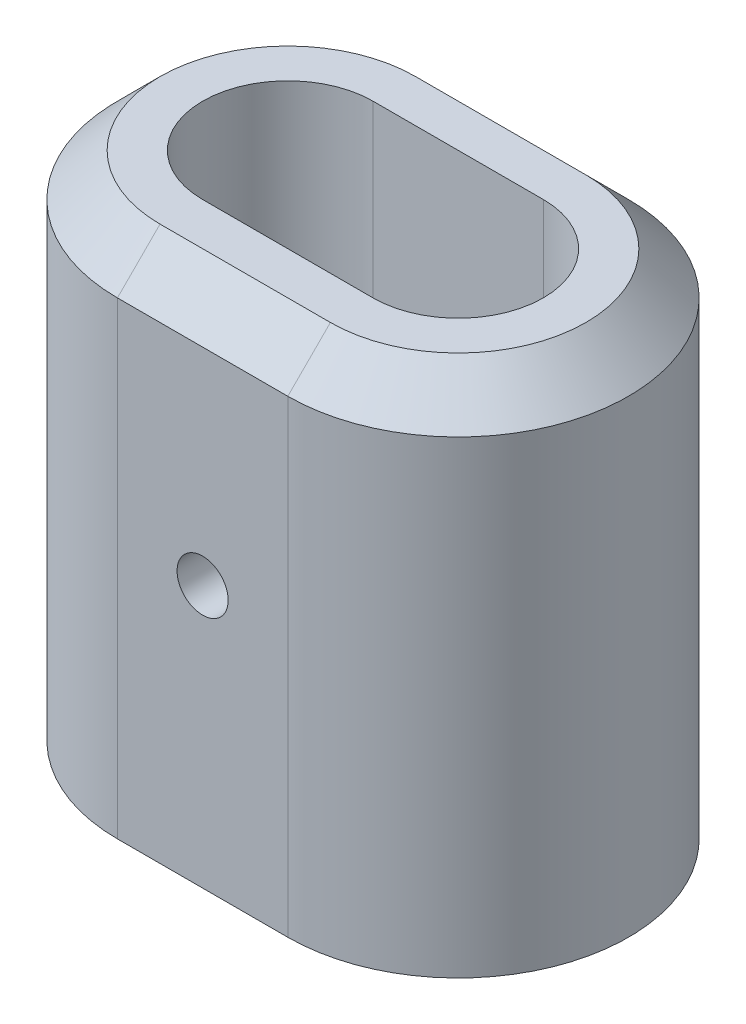
ISO-10303-21;
HEADER;
FILE_DESCRIPTION(('STEP AP214'),'2;1');
FILE_NAME('part.step','',(''),(''),'','','');
FILE_SCHEMA(('AUTOMOTIVE_DESIGN { 1 0 10303 214 1 1 1 1 }'));
ENDSEC;
DATA;
#1=APPLICATION_CONTEXT('core data for automotive mechanical design processes');
#2=APPLICATION_PROTOCOL_DEFINITION('international standard','automotive_design',2000,#1);
#3=PRODUCT_CONTEXT('',#1,'mechanical');
#4=PRODUCT('Part','Part','',(#3));
#5=PRODUCT_RELATED_PRODUCT_CATEGORY('part','',(#4));
#6=PRODUCT_DEFINITION_FORMATION('','',#4);
#7=PRODUCT_DEFINITION_CONTEXT('part definition',#1,'design');
#8=PRODUCT_DEFINITION('design','',#6,#7);
#9=PRODUCT_DEFINITION_SHAPE('','',#8);
#10=(LENGTH_UNIT() NAMED_UNIT(*) SI_UNIT(.MILLI.,.METRE.));
#11=(NAMED_UNIT(*) PLANE_ANGLE_UNIT() SI_UNIT($,.RADIAN.));
#12=(NAMED_UNIT(*) SI_UNIT($,.STERADIAN.) SOLID_ANGLE_UNIT());
#13=UNCERTAINTY_MEASURE_WITH_UNIT(LENGTH_MEASURE(1.E-05),#10,'distance_accuracy_value','');
#14=(GEOMETRIC_REPRESENTATION_CONTEXT(3) GLOBAL_UNCERTAINTY_ASSIGNED_CONTEXT((#13)) GLOBAL_UNIT_ASSIGNED_CONTEXT((#10,
#11,#12)) REPRESENTATION_CONTEXT('',''));
#15=CARTESIAN_POINT('',(0.,0.,0.));
#16=DIRECTION('',(0.,0.,1.));
#17=DIRECTION('',(1.,0.,0.));
#18=AXIS2_PLACEMENT_3D('',#15,#16,#17);
#19=CARTESIAN_POINT('',(-60.,30.,0.));
#20=DIRECTION('',(0.,1.,0.));
#21=DIRECTION('',(0.,0.,1.));
#22=AXIS2_PLACEMENT_3D('',#19,#20,#21);
#23=PLANE('',#22);
#24=DIRECTION('',(-1.,0.,0.));
#25=VECTOR('',#24,1.);
#26=CARTESIAN_POINT('',(-60.,30.,-15.));
#27=LINE('',#26,#25);
#28=CARTESIAN_POINT('',(-40.,30.,-15.));
#29=VERTEX_POINT('',#28);
#30=CARTESIAN_POINT('',(-60.,30.,-15.));
#31=VERTEX_POINT('',#30);
#32=EDGE_CURVE('E180',#29,#31,#27,.T.);
#33=ORIENTED_EDGE('',*,*,#32,.T.);
#34=CARTESIAN_POINT('',(-60.,30.,0.));
#35=DIRECTION('',(0.,1.,0.));
#36=DIRECTION('',(0.,0.,1.));
#37=AXIS2_PLACEMENT_3D('',#34,#35,#36);
#38=CIRCLE('',#37,15.);
#39=CARTESIAN_POINT('',(-60.,30.,15.));
#40=VERTEX_POINT('',#39);
#41=EDGE_CURVE('E182',#31,#40,#38,.T.);
#42=ORIENTED_EDGE('',*,*,#41,.T.);
#43=DIRECTION('',(1.,0.,0.));
#44=VECTOR('',#43,1.);
#45=CARTESIAN_POINT('',(-40.,30.,15.));
#46=LINE('',#45,#44);
#47=CARTESIAN_POINT('',(-40.,30.,15.));
#48=VERTEX_POINT('',#47);
#49=EDGE_CURVE('E178',#40,#48,#46,.T.);
#50=ORIENTED_EDGE('',*,*,#49,.T.);
#51=CARTESIAN_POINT('',(-40.,30.,0.));
#52=DIRECTION('',(0.,1.,0.));
#53=DIRECTION('',(0.,0.,1.));
#54=AXIS2_PLACEMENT_3D('',#51,#52,#53);
#55=CIRCLE('',#54,15.);
#56=EDGE_CURVE('E176',#48,#29,#55,.T.);
#57=ORIENTED_EDGE('',*,*,#56,.T.);
#58=EDGE_LOOP('',(#33,#42,#50,#57));
#59=FACE_BOUND('',#58,.T.);
#60=DIRECTION('',(1.,0.,0.));
#61=VECTOR('',#60,1.);
#62=CARTESIAN_POINT('',(-60.,30.,10.));
#63=LINE('',#62,#61);
#64=CARTESIAN_POINT('',(-60.,30.,10.));
#65=VERTEX_POINT('',#64);
#66=CARTESIAN_POINT('',(-40.,30.,10.));
#67=VERTEX_POINT('',#66);
#68=EDGE_CURVE('E124',#65,#67,#63,.T.);
#69=ORIENTED_EDGE('',*,*,#68,.F.);
#70=CARTESIAN_POINT('',(-60.,30.,0.));
#71=DIRECTION('',(0.,1.,0.));
#72=DIRECTION('',(0.,0.,1.));
#73=AXIS2_PLACEMENT_3D('',#70,#71,#72);
#74=CIRCLE('',#73,10.);
#75=CARTESIAN_POINT('',(-60.,30.,-10.));
#76=VERTEX_POINT('',#75);
#77=EDGE_CURVE('E114',#76,#65,#74,.T.);
#78=ORIENTED_EDGE('',*,*,#77,.F.);
#79=DIRECTION('',(-1.,0.,0.));
#80=VECTOR('',#79,1.);
#81=CARTESIAN_POINT('',(-60.,30.,-10.));
#82=LINE('',#81,#80);
#83=CARTESIAN_POINT('',(-40.,30.,-10.));
#84=VERTEX_POINT('',#83);
#85=EDGE_CURVE('E139',#84,#76,#82,.T.);
#86=ORIENTED_EDGE('',*,*,#85,.F.);
#87=CARTESIAN_POINT('',(-40.,30.,0.));
#88=DIRECTION('',(0.,1.,0.));
#89=DIRECTION('',(0.,0.,1.));
#90=AXIS2_PLACEMENT_3D('',#87,#88,#89);
#91=CIRCLE('',#90,10.);
#92=EDGE_CURVE('E137',#67,#84,#91,.T.);
#93=ORIENTED_EDGE('',*,*,#92,.F.);
#94=EDGE_LOOP('',(#69,#78,#86,#93));
#95=FACE_BOUND('',#94,.T.);
#96=ADVANCED_FACE('F35',(#59,#95),#23,.T.);
#97=CARTESIAN_POINT('',(-60.,-30.,0.));
#98=DIRECTION('',(0.,1.,0.));
#99=DIRECTION('',(0.,0.,1.));
#100=AXIS2_PLACEMENT_3D('',#97,#98,#99);
#101=PLANE('',#100);
#102=CARTESIAN_POINT('',(-60.,-30.,0.));
#103=DIRECTION('',(0.,1.,0.));
#104=DIRECTION('',(0.,0.,1.));
#105=AXIS2_PLACEMENT_3D('',#102,#103,#104);
#106=CIRCLE('',#105,20.);
#107=CARTESIAN_POINT('',(-60.,-30.,-20.));
#108=VERTEX_POINT('',#107);
#109=CARTESIAN_POINT('',(-60.,-30.,20.));
#110=VERTEX_POINT('',#109);
#111=EDGE_CURVE('E132',#108,#110,#106,.T.);
#112=ORIENTED_EDGE('',*,*,#111,.F.);
#113=DIRECTION('',(-1.,0.,0.));
#114=VECTOR('',#113,1.);
#115=CARTESIAN_POINT('',(-60.,-30.,-20.));
#116=LINE('',#115,#114);
#117=CARTESIAN_POINT('',(-40.,-30.,-20.));
#118=VERTEX_POINT('',#117);
#119=EDGE_CURVE('E165',#118,#108,#116,.T.);
#120=ORIENTED_EDGE('',*,*,#119,.F.);
#121=CARTESIAN_POINT('',(-40.,-30.,0.));
#122=DIRECTION('',(0.,1.,0.));
#123=DIRECTION('',(0.,0.,1.));
#124=AXIS2_PLACEMENT_3D('',#121,#122,#123);
#125=CIRCLE('',#124,20.);
#126=CARTESIAN_POINT('',(-40.,-30.,20.));
#127=VERTEX_POINT('',#126);
#128=EDGE_CURVE('E162',#127,#118,#125,.T.);
#129=ORIENTED_EDGE('',*,*,#128,.F.);
#130=DIRECTION('',(1.,0.,0.));
#131=VECTOR('',#130,1.);
#132=CARTESIAN_POINT('',(-60.,-30.,20.));
#133=LINE('',#132,#131);
#134=EDGE_CURVE('E159',#110,#127,#133,.T.);
#135=ORIENTED_EDGE('',*,*,#134,.F.);
#136=EDGE_LOOP('',(#112,#120,#129,#135));
#137=FACE_BOUND('',#136,.T.);
#138=CARTESIAN_POINT('',(-60.,-30.,0.));
#139=DIRECTION('',(0.,1.,0.));
#140=DIRECTION('',(0.,0.,1.));
#141=AXIS2_PLACEMENT_3D('',#138,#139,#140);
#142=CIRCLE('',#141,10.);
#143=CARTESIAN_POINT('',(-60.,-30.,-10.));
#144=VERTEX_POINT('',#143);
#145=CARTESIAN_POINT('',(-60.,-30.,10.));
#146=VERTEX_POINT('',#145);
#147=EDGE_CURVE('E144',#144,#146,#142,.T.);
#148=ORIENTED_EDGE('',*,*,#147,.T.);
#149=DIRECTION('',(1.,0.,0.));
#150=VECTOR('',#149,1.);
#151=CARTESIAN_POINT('',(-60.,-30.,10.));
#152=LINE('',#151,#150);
#153=CARTESIAN_POINT('',(-40.,-30.,10.));
#154=VERTEX_POINT('',#153);
#155=EDGE_CURVE('E131',#146,#154,#152,.T.);
#156=ORIENTED_EDGE('',*,*,#155,.T.);
#157=CARTESIAN_POINT('',(-40.,-30.,0.));
#158=DIRECTION('',(0.,1.,0.));
#159=DIRECTION('',(0.,0.,1.));
#160=AXIS2_PLACEMENT_3D('',#157,#158,#159);
#161=CIRCLE('',#160,10.);
#162=CARTESIAN_POINT('',(-40.,-30.,-10.));
#163=VERTEX_POINT('',#162);
#164=EDGE_CURVE('E148',#154,#163,#161,.T.);
#165=ORIENTED_EDGE('',*,*,#164,.T.);
#166=DIRECTION('',(-1.,0.,0.));
#167=VECTOR('',#166,1.);
#168=CARTESIAN_POINT('',(-60.,-30.,-10.));
#169=LINE('',#168,#167);
#170=EDGE_CURVE('E125',#163,#144,#169,.T.);
#171=ORIENTED_EDGE('',*,*,#170,.T.);
#172=EDGE_LOOP('',(#148,#156,#165,#171));
#173=FACE_BOUND('',#172,.T.);
#174=ADVANCED_FACE('F224',(#137,#173),#101,.F.);
#175=CARTESIAN_POINT('',(-60.,30.,0.));
#176=DIRECTION('',(0.,-1.,0.));
#177=DIRECTION('',(0.,0.,-1.));
#178=AXIS2_PLACEMENT_3D('',#175,#176,#177);
#179=CYLINDRICAL_SURFACE('',#178,20.);
#180=DIRECTION('',(0.,-1.,0.));
#181=VECTOR('',#180,1.);
#182=CARTESIAN_POINT('',(-60.,30.,20.));
#183=LINE('',#182,#181);
#184=CARTESIAN_POINT('',(-60.,25.,20.));
#185=VERTEX_POINT('',#184);
#186=EDGE_CURVE('E174',#185,#110,#183,.T.);
#187=ORIENTED_EDGE('',*,*,#186,.F.);
#188=CARTESIAN_POINT('',(-60.,25.,0.));
#189=DIRECTION('',(0.,1.,0.));
#190=DIRECTION('',(0.,0.,1.));
#191=AXIS2_PLACEMENT_3D('',#188,#189,#190);
#192=CIRCLE('',#191,20.);
#193=CARTESIAN_POINT('',(-60.,25.,-20.));
#194=VERTEX_POINT('',#193);
#195=EDGE_CURVE('E185',#185,#194,#192,.F.);
#196=ORIENTED_EDGE('',*,*,#195,.T.);
#197=DIRECTION('',(0.,-1.,0.));
#198=VECTOR('',#197,1.);
#199=CARTESIAN_POINT('',(-60.,30.,-20.));
#200=LINE('',#199,#198);
#201=EDGE_CURVE('E168',#194,#108,#200,.T.);
#202=ORIENTED_EDGE('',*,*,#201,.T.);
#203=ORIENTED_EDGE('',*,*,#111,.T.);
#204=EDGE_LOOP('',(#187,#196,#202,#203));
#205=FACE_BOUND('',#204,.T.);
#206=ADVANCED_FACE('F217',(#205),#179,.T.);
#207=CARTESIAN_POINT('',(-60.,30.,20.));
#208=DIRECTION('',(0.,0.,-1.));
#209=DIRECTION('',(-1.,0.,0.));
#210=AXIS2_PLACEMENT_3D('',#207,#208,#209);
#211=PLANE('',#210);
#212=CARTESIAN_POINT('',(-50.,0.749999999999997,20.));
#213=DIRECTION('',(0.,0.,1.));
#214=DIRECTION('',(1.,0.,0.));
#215=AXIS2_PLACEMENT_3D('',#212,#213,#214);
#216=CIRCLE('',#215,3.);
#217=CARTESIAN_POINT('',(-47.,0.749999999999997,20.));
#218=VERTEX_POINT('',#217);
#219=EDGE_CURVE('E280',#218,#218,#216,.T.);
#220=ORIENTED_EDGE('',*,*,#219,.F.);
#221=EDGE_LOOP('',(#220));
#222=FACE_BOUND('',#221,.T.);
#223=DIRECTION('',(0.,-1.,0.));
#224=VECTOR('',#223,1.);
#225=CARTESIAN_POINT('',(-40.,30.,20.));
#226=LINE('',#225,#224);
#227=CARTESIAN_POINT('',(-40.,25.,20.));
#228=VERTEX_POINT('',#227);
#229=EDGE_CURVE('E172',#228,#127,#226,.T.);
#230=ORIENTED_EDGE('',*,*,#229,.F.);
#231=DIRECTION('',(-1.,0.,0.));
#232=VECTOR('',#231,1.);
#233=CARTESIAN_POINT('',(-60.,25.,20.));
#234=LINE('',#233,#232);
#235=EDGE_CURVE('E44',#228,#185,#234,.T.);
#236=ORIENTED_EDGE('',*,*,#235,.T.);
#237=ORIENTED_EDGE('',*,*,#186,.T.);
#238=ORIENTED_EDGE('',*,*,#134,.T.);
#239=EDGE_LOOP('',(#230,#236,#237,#238));
#240=FACE_BOUND('',#239,.T.);
#241=ADVANCED_FACE('F213',(#222,#240),#211,.F.);
#242=CARTESIAN_POINT('',(-40.,30.,0.));
#243=DIRECTION('',(0.,-1.,0.));
#244=DIRECTION('',(0.,0.,-1.));
#245=AXIS2_PLACEMENT_3D('',#242,#243,#244);
#246=CYLINDRICAL_SURFACE('',#245,20.);
#247=DIRECTION('',(0.,-1.,0.));
#248=VECTOR('',#247,1.);
#249=CARTESIAN_POINT('',(-40.,30.,-20.));
#250=LINE('',#249,#248);
#251=CARTESIAN_POINT('',(-40.,25.,-20.));
#252=VERTEX_POINT('',#251);
#253=EDGE_CURVE('E170',#252,#118,#250,.T.);
#254=ORIENTED_EDGE('',*,*,#253,.F.);
#255=CARTESIAN_POINT('',(-40.,25.,0.));
#256=DIRECTION('',(0.,1.,0.));
#257=DIRECTION('',(0.,0.,1.));
#258=AXIS2_PLACEMENT_3D('',#255,#256,#257);
#259=CIRCLE('',#258,20.);
#260=EDGE_CURVE('E11',#252,#228,#259,.F.);
#261=ORIENTED_EDGE('',*,*,#260,.T.);
#262=ORIENTED_EDGE('',*,*,#229,.T.);
#263=ORIENTED_EDGE('',*,*,#128,.T.);
#264=EDGE_LOOP('',(#254,#261,#262,#263));
#265=FACE_BOUND('',#264,.T.);
#266=ADVANCED_FACE('F237',(#265),#246,.T.);
#267=CARTESIAN_POINT('',(-60.,30.,-20.));
#268=DIRECTION('',(0.,0.,1.));
#269=DIRECTION('',(1.,0.,0.));
#270=AXIS2_PLACEMENT_3D('',#267,#268,#269);
#271=PLANE('',#270);
#272=CARTESIAN_POINT('',(-50.,0.749999999999997,-20.));
#273=DIRECTION('',(0.,0.,1.));
#274=DIRECTION('',(1.,0.,0.));
#275=AXIS2_PLACEMENT_3D('',#272,#273,#274);
#276=CIRCLE('',#275,3.);
#277=CARTESIAN_POINT('',(-47.,0.749999999999997,-20.));
#278=VERTEX_POINT('',#277);
#279=EDGE_CURVE('E278',#278,#278,#276,.T.);
#280=ORIENTED_EDGE('',*,*,#279,.T.);
#281=EDGE_LOOP('',(#280));
#282=FACE_BOUND('',#281,.T.);
#283=ORIENTED_EDGE('',*,*,#201,.F.);
#284=DIRECTION('',(1.,0.,0.));
#285=VECTOR('',#284,1.);
#286=CARTESIAN_POINT('',(-40.,25.,-20.));
#287=LINE('',#286,#285);
#288=EDGE_CURVE('E58',#194,#252,#287,.T.);
#289=ORIENTED_EDGE('',*,*,#288,.T.);
#290=ORIENTED_EDGE('',*,*,#253,.T.);
#291=ORIENTED_EDGE('',*,*,#119,.T.);
#292=EDGE_LOOP('',(#283,#289,#290,#291));
#293=FACE_BOUND('',#292,.T.);
#294=ADVANCED_FACE('F234',(#282,#293),#271,.F.);
#295=CARTESIAN_POINT('',(-60.,30.,0.));
#296=DIRECTION('',(0.,-1.,0.));
#297=DIRECTION('',(0.,0.,-1.));
#298=AXIS2_PLACEMENT_3D('',#295,#296,#297);
#299=CYLINDRICAL_SURFACE('',#298,10.);
#300=ORIENTED_EDGE('',*,*,#147,.F.);
#301=DIRECTION('',(0.,-1.,0.));
#302=VECTOR('',#301,1.);
#303=CARTESIAN_POINT('',(-60.,30.,-10.));
#304=LINE('',#303,#302);
#305=EDGE_CURVE('E120',#76,#144,#304,.T.);
#306=ORIENTED_EDGE('',*,*,#305,.F.);
#307=ORIENTED_EDGE('',*,*,#77,.T.);
#308=DIRECTION('',(0.,-1.,0.));
#309=VECTOR('',#308,1.);
#310=CARTESIAN_POINT('',(-60.,30.,10.));
#311=LINE('',#310,#309);
#312=EDGE_CURVE('E117',#65,#146,#311,.T.);
#313=ORIENTED_EDGE('',*,*,#312,.T.);
#314=EDGE_LOOP('',(#300,#306,#307,#313));
#315=FACE_BOUND('',#314,.T.);
#316=ADVANCED_FACE('F116',(#315),#299,.F.);
#317=CARTESIAN_POINT('',(-60.,30.,10.));
#318=DIRECTION('',(0.,0.,-1.));
#319=DIRECTION('',(-1.,0.,0.));
#320=AXIS2_PLACEMENT_3D('',#317,#318,#319);
#321=PLANE('',#320);
#322=CARTESIAN_POINT('',(-50.,0.749999999999997,10.));
#323=DIRECTION('',(0.,0.,-1.));
#324=DIRECTION('',(-1.,0.,0.));
#325=AXIS2_PLACEMENT_3D('',#322,#323,#324);
#326=CIRCLE('',#325,3.);
#327=CARTESIAN_POINT('',(-53.,0.749999999999997,10.));
#328=VERTEX_POINT('',#327);
#329=EDGE_CURVE('E193',#328,#328,#326,.T.);
#330=ORIENTED_EDGE('',*,*,#329,.F.);
#331=EDGE_LOOP('',(#330));
#332=FACE_BOUND('',#331,.T.);
#333=ORIENTED_EDGE('',*,*,#155,.F.);
#334=ORIENTED_EDGE('',*,*,#312,.F.);
#335=ORIENTED_EDGE('',*,*,#68,.T.);
#336=DIRECTION('',(0.,-1.,0.));
#337=VECTOR('',#336,1.);
#338=CARTESIAN_POINT('',(-40.,30.,10.));
#339=LINE('',#338,#337);
#340=EDGE_CURVE('E133',#67,#154,#339,.T.);
#341=ORIENTED_EDGE('',*,*,#340,.T.);
#342=EDGE_LOOP('',(#333,#334,#335,#341));
#343=FACE_BOUND('',#342,.T.);
#344=ADVANCED_FACE('F128',(#332,#343),#321,.T.);
#345=CARTESIAN_POINT('',(-40.,30.,0.));
#346=DIRECTION('',(0.,-1.,0.));
#347=DIRECTION('',(0.,0.,-1.));
#348=AXIS2_PLACEMENT_3D('',#345,#346,#347);
#349=CYLINDRICAL_SURFACE('',#348,10.);
#350=ORIENTED_EDGE('',*,*,#164,.F.);
#351=ORIENTED_EDGE('',*,*,#340,.F.);
#352=ORIENTED_EDGE('',*,*,#92,.T.);
#353=DIRECTION('',(0.,-1.,0.));
#354=VECTOR('',#353,1.);
#355=CARTESIAN_POINT('',(-40.,30.,-10.));
#356=LINE('',#355,#354);
#357=EDGE_CURVE('E154',#84,#163,#356,.T.);
#358=ORIENTED_EDGE('',*,*,#357,.T.);
#359=EDGE_LOOP('',(#350,#351,#352,#358));
#360=FACE_BOUND('',#359,.T.);
#361=ADVANCED_FACE('F258',(#360),#349,.F.);
#362=CARTESIAN_POINT('',(-60.,30.,-10.));
#363=DIRECTION('',(0.,0.,1.));
#364=DIRECTION('',(1.,0.,0.));
#365=AXIS2_PLACEMENT_3D('',#362,#363,#364);
#366=PLANE('',#365);
#367=CARTESIAN_POINT('',(-50.,0.749999999999997,-10.));
#368=DIRECTION('',(0.,0.,1.));
#369=DIRECTION('',(1.,0.,0.));
#370=AXIS2_PLACEMENT_3D('',#367,#368,#369);
#371=CIRCLE('',#370,3.);
#372=CARTESIAN_POINT('',(-47.,0.749999999999997,-10.));
#373=VERTEX_POINT('',#372);
#374=EDGE_CURVE('E39',#373,#373,#371,.T.);
#375=ORIENTED_EDGE('',*,*,#374,.F.);
#376=EDGE_LOOP('',(#375));
#377=FACE_BOUND('',#376,.T.);
#378=ORIENTED_EDGE('',*,*,#170,.F.);
#379=ORIENTED_EDGE('',*,*,#357,.F.);
#380=ORIENTED_EDGE('',*,*,#85,.T.);
#381=ORIENTED_EDGE('',*,*,#305,.T.);
#382=EDGE_LOOP('',(#378,#379,#380,#381));
#383=FACE_BOUND('',#382,.T.);
#384=ADVANCED_FACE('F254',(#377,#383),#366,.T.);
#385=CARTESIAN_POINT('',(-40.,30.,0.));
#386=DIRECTION('',(0.,-1.,0.));
#387=DIRECTION('',(0.,0.,-1.));
#388=AXIS2_PLACEMENT_3D('',#385,#386,#387);
#389=CONICAL_SURFACE('',#388,15.,0.785398163397446);
#390=DIRECTION('',(0.,0.707106781186549,-0.707106781186546));
#391=VECTOR('',#390,1.);
#392=CARTESIAN_POINT('',(-40.,25.,20.));
#393=LINE('',#392,#391);
#394=EDGE_CURVE('E195',#228,#48,#393,.T.);
#395=ORIENTED_EDGE('',*,*,#394,.F.);
#396=ORIENTED_EDGE('',*,*,#260,.F.);
#397=DIRECTION('',(0.,-0.707106781186549,-0.707106781186546));
#398=VECTOR('',#397,1.);
#399=CARTESIAN_POINT('',(-40.,30.,-15.));
#400=LINE('',#399,#398);
#401=EDGE_CURVE('E146',#29,#252,#400,.T.);
#402=ORIENTED_EDGE('',*,*,#401,.F.);
#403=ORIENTED_EDGE('',*,*,#56,.F.);
#404=EDGE_LOOP('',(#395,#396,#402,#403));
#405=FACE_BOUND('',#404,.T.);
#406=ADVANCED_FACE('F37',(#405),#389,.T.);
#407=CARTESIAN_POINT('',(-60.,30.,-15.));
#408=DIRECTION('',(0.,0.707106781186546,-0.707106781186549));
#409=DIRECTION('',(1.,0.,0.));
#410=AXIS2_PLACEMENT_3D('',#407,#408,#409);
#411=PLANE('',#410);
#412=ORIENTED_EDGE('',*,*,#401,.T.);
#413=ORIENTED_EDGE('',*,*,#288,.F.);
#414=DIRECTION('',(0.,-0.707106781186549,-0.707106781186546));
#415=VECTOR('',#414,1.);
#416=CARTESIAN_POINT('',(-60.,30.,-15.));
#417=LINE('',#416,#415);
#418=EDGE_CURVE('E192',#31,#194,#417,.T.);
#419=ORIENTED_EDGE('',*,*,#418,.F.);
#420=ORIENTED_EDGE('',*,*,#32,.F.);
#421=EDGE_LOOP('',(#412,#413,#419,#420));
#422=FACE_BOUND('',#421,.T.);
#423=ADVANCED_FACE('F201',(#422),#411,.T.);
#424=CARTESIAN_POINT('',(-60.,30.,15.));
#425=DIRECTION('',(0.,0.707106781186546,0.707106781186549));
#426=DIRECTION('',(-1.,0.,0.));
#427=AXIS2_PLACEMENT_3D('',#424,#425,#426);
#428=PLANE('',#427);
#429=ORIENTED_EDGE('',*,*,#394,.T.);
#430=ORIENTED_EDGE('',*,*,#49,.F.);
#431=DIRECTION('',(0.,0.707106781186549,-0.707106781186546));
#432=VECTOR('',#431,1.);
#433=CARTESIAN_POINT('',(-60.,25.,20.));
#434=LINE('',#433,#432);
#435=EDGE_CURVE('E190',#185,#40,#434,.T.);
#436=ORIENTED_EDGE('',*,*,#435,.F.);
#437=ORIENTED_EDGE('',*,*,#235,.F.);
#438=EDGE_LOOP('',(#429,#430,#436,#437));
#439=FACE_BOUND('',#438,.T.);
#440=ADVANCED_FACE('F210',(#439),#428,.T.);
#441=CARTESIAN_POINT('',(-60.,30.,0.));
#442=DIRECTION('',(0.,-1.,0.));
#443=DIRECTION('',(0.,0.,-1.));
#444=AXIS2_PLACEMENT_3D('',#441,#442,#443);
#445=CONICAL_SURFACE('',#444,15.,0.785398163397446);
#446=ORIENTED_EDGE('',*,*,#418,.T.);
#447=ORIENTED_EDGE('',*,*,#195,.F.);
#448=ORIENTED_EDGE('',*,*,#435,.T.);
#449=ORIENTED_EDGE('',*,*,#41,.F.);
#450=EDGE_LOOP('',(#446,#447,#448,#449));
#451=FACE_BOUND('',#450,.T.);
#452=ADVANCED_FACE('F220',(#451),#445,.T.);
#453=CARTESIAN_POINT('',(-50.,0.749999999999997,-20.));
#454=DIRECTION('',(0.,0.,1.));
#455=DIRECTION('',(1.,0.,0.));
#456=AXIS2_PLACEMENT_3D('',#453,#454,#455);
#457=CYLINDRICAL_SURFACE('',#456,3.);
#458=ORIENTED_EDGE('',*,*,#374,.T.);
#459=EDGE_LOOP('',(#458));
#460=FACE_BOUND('',#459,.T.);
#461=ORIENTED_EDGE('',*,*,#279,.F.);
#462=EDGE_LOOP('',(#461));
#463=FACE_BOUND('',#462,.T.);
#464=ADVANCED_FACE('F248',(#460,#463),#457,.F.);
#465=ORIENTED_EDGE('',*,*,#329,.T.);
#466=EDGE_LOOP('',(#465));
#467=FACE_BOUND('',#466,.T.);
#468=ORIENTED_EDGE('',*,*,#219,.T.);
#469=EDGE_LOOP('',(#468));
#470=FACE_BOUND('',#469,.T.);
#471=ADVANCED_FACE('F287',(#467,#470),#457,.F.);
#472=CLOSED_SHELL('',(#96,#174,#206,#241,#266,#294,#316,#344,#361,#384,#406,#423,#440,#452,#464,#471));
#473=MANIFOLD_SOLID_BREP('B2',#472);
#474=ADVANCED_BREP_SHAPE_REPRESENTATION('',(#18,#473),#14);
#475=SHAPE_DEFINITION_REPRESENTATION(#9,#474);
ENDSEC;
END-ISO-10303-21;
